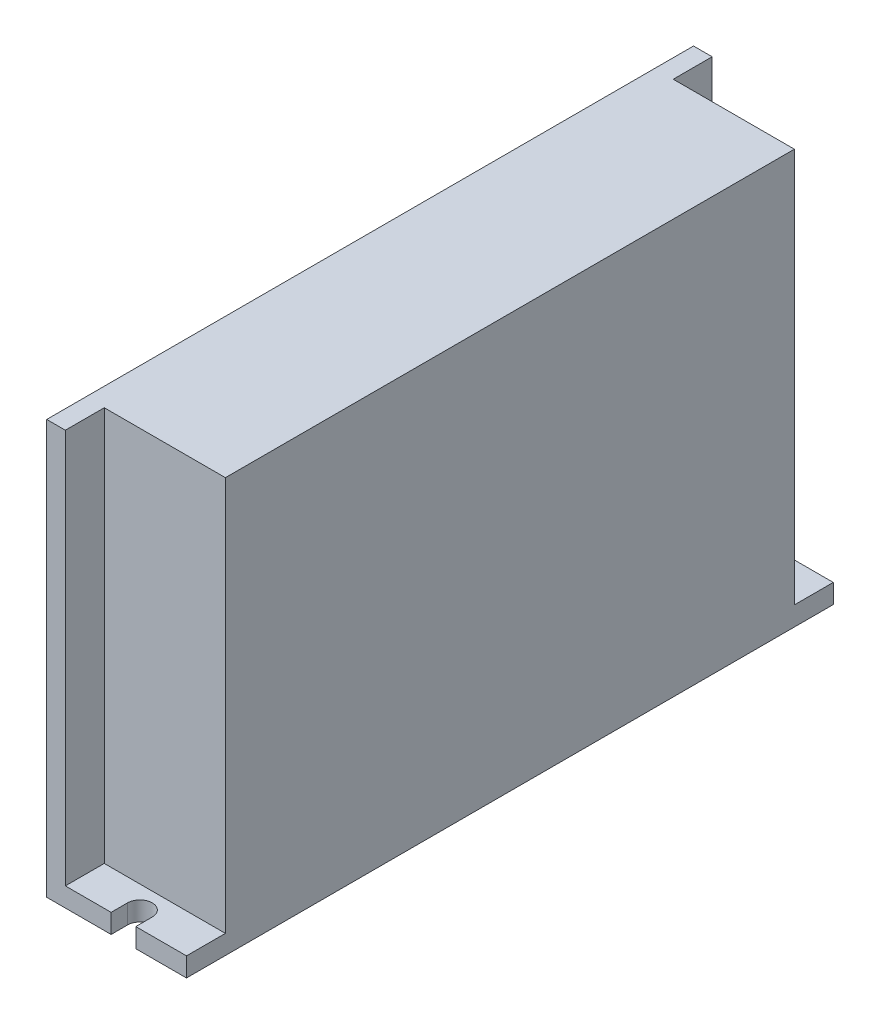
ISO-10303-21;
HEADER;
FILE_DESCRIPTION(('STEP AP214'),'2;1');
FILE_NAME('part.step','',(''),(''),'','','');
FILE_SCHEMA(('AUTOMOTIVE_DESIGN { 1 0 10303 214 1 1 1 1 }'));
ENDSEC;
DATA;
#1=APPLICATION_CONTEXT('core data for automotive mechanical design processes');
#2=APPLICATION_PROTOCOL_DEFINITION('international standard','automotive_design',2000,#1);
#3=PRODUCT_CONTEXT('',#1,'mechanical');
#4=PRODUCT('Part','Part','',(#3));
#5=PRODUCT_RELATED_PRODUCT_CATEGORY('part','',(#4));
#6=PRODUCT_DEFINITION_FORMATION('','',#4);
#7=PRODUCT_DEFINITION_CONTEXT('part definition',#1,'design');
#8=PRODUCT_DEFINITION('design','',#6,#7);
#9=PRODUCT_DEFINITION_SHAPE('','',#8);
#10=(LENGTH_UNIT() NAMED_UNIT(*) SI_UNIT(.MILLI.,.METRE.));
#11=(NAMED_UNIT(*) PLANE_ANGLE_UNIT() SI_UNIT($,.RADIAN.));
#12=(NAMED_UNIT(*) SI_UNIT($,.STERADIAN.) SOLID_ANGLE_UNIT());
#13=UNCERTAINTY_MEASURE_WITH_UNIT(LENGTH_MEASURE(1.E-05),#10,'distance_accuracy_value','');
#14=(GEOMETRIC_REPRESENTATION_CONTEXT(3) GLOBAL_UNCERTAINTY_ASSIGNED_CONTEXT((#13)) GLOBAL_UNIT_ASSIGNED_CONTEXT((#10,
#11,#12)) REPRESENTATION_CONTEXT('',''));
#15=CARTESIAN_POINT('',(0.,0.,0.));
#16=DIRECTION('',(0.,0.,1.));
#17=DIRECTION('',(1.,0.,0.));
#18=AXIS2_PLACEMENT_3D('',#15,#16,#17);
#19=CARTESIAN_POINT('',(0.,3.5,0.));
#20=DIRECTION('',(0.,-1.,0.));
#21=DIRECTION('',(0.,0.,-1.));
#22=AXIS2_PLACEMENT_3D('',#19,#20,#21);
#23=PLANE('',#22);
#24=DIRECTION('',(-1.,0.,0.));
#25=VECTOR('',#24,1.);
#26=CARTESIAN_POINT('',(-9.35,3.5,-51.9));
#27=LINE('',#26,#25);
#28=CARTESIAN_POINT('',(12.75,3.5,-51.9));
#29=VERTEX_POINT('',#28);
#30=CARTESIAN_POINT('',(-9.35,3.5,-51.9));
#31=VERTEX_POINT('',#30);
#32=EDGE_CURVE('E335',#29,#31,#27,.T.);
#33=ORIENTED_EDGE('',*,*,#32,.F.);
#34=DIRECTION('',(0.,0.,-1.));
#35=VECTOR('',#34,1.);
#36=CARTESIAN_POINT('',(12.75,3.5,59.));
#37=LINE('',#36,#35);
#38=CARTESIAN_POINT('',(12.75,3.5,-59.));
#39=VERTEX_POINT('',#38);
#40=EDGE_CURVE('E191',#29,#39,#37,.T.);
#41=ORIENTED_EDGE('',*,*,#40,.T.);
#42=DIRECTION('',(-1.,0.,0.));
#43=VECTOR('',#42,1.);
#44=CARTESIAN_POINT('',(-12.75,3.5,-59.));
#45=LINE('',#44,#43);
#46=CARTESIAN_POINT('',(3.49999999999999,3.5,-59.));
#47=VERTEX_POINT('',#46);
#48=EDGE_CURVE('E273',#39,#47,#45,.T.);
#49=ORIENTED_EDGE('',*,*,#48,.T.);
#50=DIRECTION('',(0.,0.,-1.));
#51=VECTOR('',#50,1.);
#52=CARTESIAN_POINT('',(3.49999999999999,3.5,-56.));
#53=LINE('',#52,#51);
#54=CARTESIAN_POINT('',(3.49999999999999,3.5,-56.));
#55=VERTEX_POINT('',#54);
#56=EDGE_CURVE('E257',#55,#47,#53,.T.);
#57=ORIENTED_EDGE('',*,*,#56,.F.);
#58=CARTESIAN_POINT('',(1.24999999999999,3.5,-56.));
#59=DIRECTION('',(0.,1.,0.));
#60=DIRECTION('',(0.,0.,1.));
#61=AXIS2_PLACEMENT_3D('',#58,#59,#60);
#62=CIRCLE('',#61,2.25);
#63=CARTESIAN_POINT('',(-1.00000000000001,3.5,-56.));
#64=VERTEX_POINT('',#63);
#65=EDGE_CURVE('E231',#64,#55,#62,.T.);
#66=ORIENTED_EDGE('',*,*,#65,.F.);
#67=DIRECTION('',(0.,0.,1.));
#68=VECTOR('',#67,1.);
#69=CARTESIAN_POINT('',(-1.00000000000001,3.5,-56.));
#70=LINE('',#69,#68);
#71=CARTESIAN_POINT('',(-1.00000000000002,3.5,-59.));
#72=VERTEX_POINT('',#71);
#73=EDGE_CURVE('E254',#72,#64,#70,.T.);
#74=ORIENTED_EDGE('',*,*,#73,.F.);
#75=CARTESIAN_POINT('',(-9.35,3.5,-59.));
#76=VERTEX_POINT('',#75);
#77=EDGE_CURVE('E272',#72,#76,#45,.T.);
#78=ORIENTED_EDGE('',*,*,#77,.T.);
#79=DIRECTION('',(0.,0.,-1.));
#80=VECTOR('',#79,1.);
#81=CARTESIAN_POINT('',(-9.35,3.5,-59.));
#82=LINE('',#81,#80);
#83=EDGE_CURVE('E192',#31,#76,#82,.T.);
#84=ORIENTED_EDGE('',*,*,#83,.F.);
#85=EDGE_LOOP('',(#33,#41,#49,#57,#66,#74,#78,#84));
#86=FACE_BOUND('',#85,.T.);
#87=ADVANCED_FACE('F45',(#86),#23,.F.);
#88=DIRECTION('',(1.,0.,0.));
#89=VECTOR('',#88,1.);
#90=CARTESIAN_POINT('',(-9.35,3.5,51.9));
#91=LINE('',#90,#89);
#92=CARTESIAN_POINT('',(-9.35,3.5,51.9));
#93=VERTEX_POINT('',#92);
#94=CARTESIAN_POINT('',(12.75,3.5,51.9));
#95=VERTEX_POINT('',#94);
#96=EDGE_CURVE('E186',#93,#95,#91,.T.);
#97=ORIENTED_EDGE('',*,*,#96,.F.);
#98=CARTESIAN_POINT('',(-9.34999999999999,3.5,59.));
#99=VERTEX_POINT('',#98);
#100=EDGE_CURVE('E68',#99,#93,#82,.T.);
#101=ORIENTED_EDGE('',*,*,#100,.F.);
#102=DIRECTION('',(1.,0.,0.));
#103=VECTOR('',#102,1.);
#104=CARTESIAN_POINT('',(-12.75,3.5,59.));
#105=LINE('',#104,#103);
#106=CARTESIAN_POINT('',(-1.,3.5,59.));
#107=VERTEX_POINT('',#106);
#108=EDGE_CURVE('E277',#99,#107,#105,.T.);
#109=ORIENTED_EDGE('',*,*,#108,.T.);
#110=DIRECTION('',(0.,0.,1.));
#111=VECTOR('',#110,1.);
#112=CARTESIAN_POINT('',(-1.,3.5,56.));
#113=LINE('',#112,#111);
#114=CARTESIAN_POINT('',(-1.,3.5,56.));
#115=VERTEX_POINT('',#114);
#116=EDGE_CURVE('E230',#115,#107,#113,.T.);
#117=ORIENTED_EDGE('',*,*,#116,.F.);
#118=CARTESIAN_POINT('',(1.25,3.5,56.));
#119=DIRECTION('',(0.,1.,0.));
#120=DIRECTION('',(0.,0.,1.));
#121=AXIS2_PLACEMENT_3D('',#118,#119,#120);
#122=CIRCLE('',#121,2.25);
#123=CARTESIAN_POINT('',(3.5,3.5,56.));
#124=VERTEX_POINT('',#123);
#125=EDGE_CURVE('E227',#124,#115,#122,.T.);
#126=ORIENTED_EDGE('',*,*,#125,.F.);
#127=DIRECTION('',(0.,0.,-1.));
#128=VECTOR('',#127,1.);
#129=CARTESIAN_POINT('',(3.5,3.5,56.));
#130=LINE('',#129,#128);
#131=CARTESIAN_POINT('',(3.5,3.5,59.));
#132=VERTEX_POINT('',#131);
#133=EDGE_CURVE('E220',#132,#124,#130,.T.);
#134=ORIENTED_EDGE('',*,*,#133,.F.);
#135=CARTESIAN_POINT('',(12.75,3.5,59.));
#136=VERTEX_POINT('',#135);
#137=EDGE_CURVE('E276',#132,#136,#105,.T.);
#138=ORIENTED_EDGE('',*,*,#137,.T.);
#139=EDGE_CURVE('E269',#136,#95,#37,.T.);
#140=ORIENTED_EDGE('',*,*,#139,.T.);
#141=EDGE_LOOP('',(#97,#101,#109,#117,#126,#134,#138,#140));
#142=FACE_BOUND('',#141,.T.);
#143=ADVANCED_FACE('F345',(#142),#23,.F.);
#144=CARTESIAN_POINT('',(-9.35,75.5,-59.));
#145=DIRECTION('',(-1.,0.,0.));
#146=DIRECTION('',(0.,0.,1.));
#147=AXIS2_PLACEMENT_3D('',#144,#145,#146);
#148=PLANE('',#147);
#149=DIRECTION('',(0.,-1.,0.));
#150=VECTOR('',#149,1.);
#151=CARTESIAN_POINT('',(-9.35,75.5,-51.9));
#152=LINE('',#151,#150);
#153=CARTESIAN_POINT('',(-9.35,75.5,-51.9));
#154=VERTEX_POINT('',#153);
#155=EDGE_CURVE('E60',#154,#31,#152,.T.);
#156=ORIENTED_EDGE('',*,*,#155,.T.);
#157=ORIENTED_EDGE('',*,*,#83,.T.);
#158=DIRECTION('',(0.,-1.,0.));
#159=VECTOR('',#158,1.);
#160=CARTESIAN_POINT('',(-9.35,75.5,-59.));
#161=LINE('',#160,#159);
#162=CARTESIAN_POINT('',(-9.35,75.5,-59.));
#163=VERTEX_POINT('',#162);
#164=EDGE_CURVE('E208',#163,#76,#161,.T.);
#165=ORIENTED_EDGE('',*,*,#164,.F.);
#166=DIRECTION('',(0.,0.,-1.));
#167=VECTOR('',#166,1.);
#168=CARTESIAN_POINT('',(-9.35,75.5,-59.));
#169=LINE('',#168,#167);
#170=EDGE_CURVE('E203',#154,#163,#169,.T.);
#171=ORIENTED_EDGE('',*,*,#170,.F.);
#172=EDGE_LOOP('',(#156,#157,#165,#171));
#173=FACE_BOUND('',#172,.T.);
#174=ADVANCED_FACE('F318',(#173),#148,.F.);
#175=DIRECTION('',(0.,-1.,0.));
#176=VECTOR('',#175,1.);
#177=CARTESIAN_POINT('',(-9.35,75.5,51.9));
#178=LINE('',#177,#176);
#179=CARTESIAN_POINT('',(-9.35,75.5,51.9));
#180=VERTEX_POINT('',#179);
#181=EDGE_CURVE('E195',#180,#93,#178,.T.);
#182=ORIENTED_EDGE('',*,*,#181,.F.);
#183=CARTESIAN_POINT('',(-9.34999999999999,75.5,59.));
#184=VERTEX_POINT('',#183);
#185=EDGE_CURVE('E204',#184,#180,#169,.T.);
#186=ORIENTED_EDGE('',*,*,#185,.F.);
#187=DIRECTION('',(0.,-1.,0.));
#188=VECTOR('',#187,1.);
#189=CARTESIAN_POINT('',(-9.34999999999999,75.5,59.));
#190=LINE('',#189,#188);
#191=EDGE_CURVE('E212',#184,#99,#190,.T.);
#192=ORIENTED_EDGE('',*,*,#191,.T.);
#193=ORIENTED_EDGE('',*,*,#100,.T.);
#194=EDGE_LOOP('',(#182,#186,#192,#193));
#195=FACE_BOUND('',#194,.T.);
#196=ADVANCED_FACE('F347',(#195),#148,.F.);
#197=CARTESIAN_POINT('',(-12.75,3.5,-59.));
#198=DIRECTION('',(0.,0.,1.));
#199=DIRECTION('',(1.,0.,0.));
#200=AXIS2_PLACEMENT_3D('',#197,#198,#199);
#201=PLANE('',#200);
#202=ORIENTED_EDGE('',*,*,#77,.F.);
#203=DIRECTION('',(0.,1.,0.));
#204=VECTOR('',#203,1.);
#205=CARTESIAN_POINT('',(-1.00000000000002,0.,-59.));
#206=LINE('',#205,#204);
#207=CARTESIAN_POINT('',(-1.00000000000002,0.,-59.));
#208=VERTEX_POINT('',#207);
#209=EDGE_CURVE('E251',#208,#72,#206,.T.);
#210=ORIENTED_EDGE('',*,*,#209,.F.);
#211=DIRECTION('',(-1.,0.,0.));
#212=VECTOR('',#211,1.);
#213=CARTESIAN_POINT('',(-12.75,0.,-59.));
#214=LINE('',#213,#212);
#215=CARTESIAN_POINT('',(-12.75,0.,-59.));
#216=VERTEX_POINT('',#215);
#217=EDGE_CURVE('E281',#208,#216,#214,.T.);
#218=ORIENTED_EDGE('',*,*,#217,.T.);
#219=DIRECTION('',(0.,-1.,0.));
#220=VECTOR('',#219,1.);
#221=CARTESIAN_POINT('',(-12.75,3.5,-59.));
#222=LINE('',#221,#220);
#223=CARTESIAN_POINT('',(-12.75,75.5,-59.));
#224=VERTEX_POINT('',#223);
#225=EDGE_CURVE('E53',#224,#216,#222,.T.);
#226=ORIENTED_EDGE('',*,*,#225,.F.);
#227=DIRECTION('',(-1.,0.,0.));
#228=VECTOR('',#227,1.);
#229=CARTESIAN_POINT('',(-12.75,75.5,-59.));
#230=LINE('',#229,#228);
#231=EDGE_CURVE('E206',#163,#224,#230,.T.);
#232=ORIENTED_EDGE('',*,*,#231,.F.);
#233=ORIENTED_EDGE('',*,*,#164,.T.);
#234=EDGE_LOOP('',(#202,#210,#218,#226,#232,#233));
#235=FACE_BOUND('',#234,.T.);
#236=ADVANCED_FACE('F314',(#235),#201,.F.);
#237=CARTESIAN_POINT('',(-12.75,3.5,59.));
#238=DIRECTION('',(0.,0.,-1.));
#239=DIRECTION('',(-1.,0.,0.));
#240=AXIS2_PLACEMENT_3D('',#237,#238,#239);
#241=PLANE('',#240);
#242=ORIENTED_EDGE('',*,*,#137,.F.);
#243=DIRECTION('',(0.,1.,0.));
#244=VECTOR('',#243,1.);
#245=CARTESIAN_POINT('',(3.5,0.,59.));
#246=LINE('',#245,#244);
#247=CARTESIAN_POINT('',(3.5,0.,59.));
#248=VERTEX_POINT('',#247);
#249=EDGE_CURVE('E239',#248,#132,#246,.T.);
#250=ORIENTED_EDGE('',*,*,#249,.F.);
#251=DIRECTION('',(1.,0.,0.));
#252=VECTOR('',#251,1.);
#253=CARTESIAN_POINT('',(-12.75,0.,59.));
#254=LINE('',#253,#252);
#255=CARTESIAN_POINT('',(12.75,0.,59.));
#256=VERTEX_POINT('',#255);
#257=EDGE_CURVE('E287',#248,#256,#254,.T.);
#258=ORIENTED_EDGE('',*,*,#257,.T.);
#259=DIRECTION('',(0.,-1.,0.));
#260=VECTOR('',#259,1.);
#261=CARTESIAN_POINT('',(12.75,3.5,59.));
#262=LINE('',#261,#260);
#263=EDGE_CURVE('E279',#136,#256,#262,.T.);
#264=ORIENTED_EDGE('',*,*,#263,.F.);
#265=EDGE_LOOP('',(#242,#250,#258,#264));
#266=FACE_BOUND('',#265,.T.);
#267=ADVANCED_FACE('F355',(#266),#241,.F.);
#268=CARTESIAN_POINT('',(12.75,3.5,59.));
#269=DIRECTION('',(-1.,0.,0.));
#270=DIRECTION('',(0.,0.,1.));
#271=AXIS2_PLACEMENT_3D('',#268,#269,#270);
#272=PLANE('',#271);
#273=DIRECTION('',(0.,0.,-1.));
#274=VECTOR('',#273,1.);
#275=CARTESIAN_POINT('',(12.75,0.,59.));
#276=LINE('',#275,#274);
#277=CARTESIAN_POINT('',(12.75,0.,-59.));
#278=VERTEX_POINT('',#277);
#279=EDGE_CURVE('E238',#256,#278,#276,.T.);
#280=ORIENTED_EDGE('',*,*,#279,.T.);
#281=DIRECTION('',(0.,-1.,0.));
#282=VECTOR('',#281,1.);
#283=CARTESIAN_POINT('',(12.75,3.5,-59.));
#284=LINE('',#283,#282);
#285=EDGE_CURVE('E11',#39,#278,#284,.T.);
#286=ORIENTED_EDGE('',*,*,#285,.F.);
#287=ORIENTED_EDGE('',*,*,#40,.F.);
#288=DIRECTION('',(0.,-1.,0.));
#289=VECTOR('',#288,1.);
#290=CARTESIAN_POINT('',(12.75,75.5,-51.9));
#291=LINE('',#290,#289);
#292=CARTESIAN_POINT('',(12.75,75.5,-51.9));
#293=VERTEX_POINT('',#292);
#294=EDGE_CURVE('E172',#293,#29,#291,.T.);
#295=ORIENTED_EDGE('',*,*,#294,.F.);
#296=DIRECTION('',(0.,0.,-1.));
#297=VECTOR('',#296,1.);
#298=CARTESIAN_POINT('',(12.75,75.5,51.9));
#299=LINE('',#298,#297);
#300=CARTESIAN_POINT('',(12.75,75.5,51.9));
#301=VERTEX_POINT('',#300);
#302=EDGE_CURVE('E177',#301,#293,#299,.T.);
#303=ORIENTED_EDGE('',*,*,#302,.F.);
#304=DIRECTION('',(0.,-1.,0.));
#305=VECTOR('',#304,1.);
#306=CARTESIAN_POINT('',(12.75,75.5,51.9));
#307=LINE('',#306,#305);
#308=EDGE_CURVE('E340',#301,#95,#307,.T.);
#309=ORIENTED_EDGE('',*,*,#308,.T.);
#310=ORIENTED_EDGE('',*,*,#139,.F.);
#311=ORIENTED_EDGE('',*,*,#263,.T.);
#312=EDGE_LOOP('',(#280,#286,#287,#295,#303,#309,#310,#311));
#313=FACE_BOUND('',#312,.T.);
#314=ADVANCED_FACE('F47',(#313),#272,.F.);
#315=CARTESIAN_POINT('',(3.49999999999999,0.,-59.));
#316=VERTEX_POINT('',#315);
#317=EDGE_CURVE('E282',#278,#316,#214,.T.);
#318=ORIENTED_EDGE('',*,*,#317,.T.);
#319=DIRECTION('',(0.,1.,0.));
#320=VECTOR('',#319,1.);
#321=CARTESIAN_POINT('',(3.49999999999999,0.,-59.));
#322=LINE('',#321,#320);
#323=EDGE_CURVE('E248',#316,#47,#322,.T.);
#324=ORIENTED_EDGE('',*,*,#323,.T.);
#325=ORIENTED_EDGE('',*,*,#48,.F.);
#326=ORIENTED_EDGE('',*,*,#285,.T.);
#327=EDGE_LOOP('',(#318,#324,#325,#326));
#328=FACE_BOUND('',#327,.T.);
#329=ADVANCED_FACE('F334',(#328),#201,.F.);
#330=CARTESIAN_POINT('',(-12.75,3.5,59.));
#331=DIRECTION('',(1.,0.,0.));
#332=DIRECTION('',(0.,0.,-1.));
#333=AXIS2_PLACEMENT_3D('',#330,#331,#332);
#334=PLANE('',#333);
#335=DIRECTION('',(0.,0.,1.));
#336=VECTOR('',#335,1.);
#337=CARTESIAN_POINT('',(-12.75,0.,59.));
#338=LINE('',#337,#336);
#339=CARTESIAN_POINT('',(-12.75,0.,59.));
#340=VERTEX_POINT('',#339);
#341=EDGE_CURVE('E285',#216,#340,#338,.T.);
#342=ORIENTED_EDGE('',*,*,#341,.T.);
#343=DIRECTION('',(0.,-1.,0.));
#344=VECTOR('',#343,1.);
#345=CARTESIAN_POINT('',(-12.75,3.5,59.));
#346=LINE('',#345,#344);
#347=CARTESIAN_POINT('',(-12.75,75.5,59.));
#348=VERTEX_POINT('',#347);
#349=EDGE_CURVE('E293',#348,#340,#346,.T.);
#350=ORIENTED_EDGE('',*,*,#349,.F.);
#351=DIRECTION('',(0.,0.,1.));
#352=VECTOR('',#351,1.);
#353=CARTESIAN_POINT('',(-12.75,75.5,-59.));
#354=LINE('',#353,#352);
#355=EDGE_CURVE('E199',#224,#348,#354,.T.);
#356=ORIENTED_EDGE('',*,*,#355,.F.);
#357=ORIENTED_EDGE('',*,*,#225,.T.);
#358=EDGE_LOOP('',(#342,#350,#356,#357));
#359=FACE_BOUND('',#358,.T.);
#360=ADVANCED_FACE('F299',(#359),#334,.F.);
#361=CARTESIAN_POINT('',(-1.,0.,59.));
#362=VERTEX_POINT('',#361);
#363=EDGE_CURVE('E288',#340,#362,#254,.T.);
#364=ORIENTED_EDGE('',*,*,#363,.T.);
#365=DIRECTION('',(0.,1.,0.));
#366=VECTOR('',#365,1.);
#367=CARTESIAN_POINT('',(-1.,0.,59.));
#368=LINE('',#367,#366);
#369=EDGE_CURVE('E241',#362,#107,#368,.T.);
#370=ORIENTED_EDGE('',*,*,#369,.T.);
#371=ORIENTED_EDGE('',*,*,#108,.F.);
#372=ORIENTED_EDGE('',*,*,#191,.F.);
#373=DIRECTION('',(1.,0.,0.));
#374=VECTOR('',#373,1.);
#375=CARTESIAN_POINT('',(-12.75,75.5,59.));
#376=LINE('',#375,#374);
#377=EDGE_CURVE('E201',#348,#184,#376,.T.);
#378=ORIENTED_EDGE('',*,*,#377,.F.);
#379=ORIENTED_EDGE('',*,*,#349,.T.);
#380=EDGE_LOOP('',(#364,#370,#371,#372,#378,#379));
#381=FACE_BOUND('',#380,.T.);
#382=ADVANCED_FACE('F308',(#381),#241,.F.);
#383=CARTESIAN_POINT('',(0.,0.,0.));
#384=DIRECTION('',(0.,-1.,0.));
#385=DIRECTION('',(0.,0.,-1.));
#386=AXIS2_PLACEMENT_3D('',#383,#384,#385);
#387=PLANE('',#386);
#388=DIRECTION('',(0.,0.,-1.));
#389=VECTOR('',#388,1.);
#390=CARTESIAN_POINT('',(3.5,0.,56.));
#391=LINE('',#390,#389);
#392=CARTESIAN_POINT('',(3.5,0.,56.));
#393=VERTEX_POINT('',#392);
#394=EDGE_CURVE('E223',#248,#393,#391,.T.);
#395=ORIENTED_EDGE('',*,*,#394,.T.);
#396=CARTESIAN_POINT('',(1.25,0.,56.));
#397=DIRECTION('',(0.,1.,0.));
#398=DIRECTION('',(0.,0.,1.));
#399=AXIS2_PLACEMENT_3D('',#396,#397,#398);
#400=CIRCLE('',#399,2.25);
#401=CARTESIAN_POINT('',(-1.,0.,56.));
#402=VERTEX_POINT('',#401);
#403=EDGE_CURVE('E216',#393,#402,#400,.T.);
#404=ORIENTED_EDGE('',*,*,#403,.T.);
#405=DIRECTION('',(0.,0.,1.));
#406=VECTOR('',#405,1.);
#407=CARTESIAN_POINT('',(-1.,0.,56.));
#408=LINE('',#407,#406);
#409=EDGE_CURVE('E219',#402,#362,#408,.T.);
#410=ORIENTED_EDGE('',*,*,#409,.T.);
#411=ORIENTED_EDGE('',*,*,#363,.F.);
#412=ORIENTED_EDGE('',*,*,#341,.F.);
#413=ORIENTED_EDGE('',*,*,#217,.F.);
#414=DIRECTION('',(0.,0.,1.));
#415=VECTOR('',#414,1.);
#416=CARTESIAN_POINT('',(-1.00000000000001,0.,-56.));
#417=LINE('',#416,#415);
#418=CARTESIAN_POINT('',(-1.00000000000001,0.,-56.));
#419=VERTEX_POINT('',#418);
#420=EDGE_CURVE('E247',#208,#419,#417,.T.);
#421=ORIENTED_EDGE('',*,*,#420,.T.);
#422=CARTESIAN_POINT('',(1.24999999999999,0.,-56.));
#423=DIRECTION('',(0.,1.,0.));
#424=DIRECTION('',(0.,0.,1.));
#425=AXIS2_PLACEMENT_3D('',#422,#423,#424);
#426=CIRCLE('',#425,2.25);
#427=CARTESIAN_POINT('',(3.49999999999999,0.,-56.));
#428=VERTEX_POINT('',#427);
#429=EDGE_CURVE('E258',#419,#428,#426,.T.);
#430=ORIENTED_EDGE('',*,*,#429,.T.);
#431=DIRECTION('',(0.,0.,-1.));
#432=VECTOR('',#431,1.);
#433=CARTESIAN_POINT('',(3.49999999999999,0.,-56.));
#434=LINE('',#433,#432);
#435=EDGE_CURVE('E264',#428,#316,#434,.T.);
#436=ORIENTED_EDGE('',*,*,#435,.T.);
#437=ORIENTED_EDGE('',*,*,#317,.F.);
#438=ORIENTED_EDGE('',*,*,#279,.F.);
#439=ORIENTED_EDGE('',*,*,#257,.F.);
#440=EDGE_LOOP('',(#395,#404,#410,#411,#412,#413,#421,#430,#436,#437,#438,#439));
#441=FACE_BOUND('',#440,.T.);
#442=ADVANCED_FACE('F305',(#441),#387,.T.);
#443=CARTESIAN_POINT('',(1.24999999999999,0.,-56.));
#444=DIRECTION('',(0.,1.,0.));
#445=DIRECTION('',(0.,0.,1.));
#446=AXIS2_PLACEMENT_3D('',#443,#444,#445);
#447=CYLINDRICAL_SURFACE('',#446,2.25);
#448=ORIENTED_EDGE('',*,*,#65,.T.);
#449=DIRECTION('',(0.,1.,0.));
#450=VECTOR('',#449,1.);
#451=CARTESIAN_POINT('',(3.49999999999999,0.,-56.));
#452=LINE('',#451,#450);
#453=EDGE_CURVE('E245',#428,#55,#452,.T.);
#454=ORIENTED_EDGE('',*,*,#453,.F.);
#455=ORIENTED_EDGE('',*,*,#429,.F.);
#456=DIRECTION('',(0.,1.,0.));
#457=VECTOR('',#456,1.);
#458=CARTESIAN_POINT('',(-1.00000000000001,0.,-56.));
#459=LINE('',#458,#457);
#460=EDGE_CURVE('E215',#419,#64,#459,.T.);
#461=ORIENTED_EDGE('',*,*,#460,.T.);
#462=EDGE_LOOP('',(#448,#454,#455,#461));
#463=FACE_BOUND('',#462,.T.);
#464=ADVANCED_FACE('F329',(#463),#447,.F.);
#465=CARTESIAN_POINT('',(-1.00000000000001,0.,-56.));
#466=DIRECTION('',(-1.,0.,0.));
#467=DIRECTION('',(0.,0.,1.));
#468=AXIS2_PLACEMENT_3D('',#465,#466,#467);
#469=PLANE('',#468);
#470=ORIENTED_EDGE('',*,*,#73,.T.);
#471=ORIENTED_EDGE('',*,*,#460,.F.);
#472=ORIENTED_EDGE('',*,*,#420,.F.);
#473=ORIENTED_EDGE('',*,*,#209,.T.);
#474=EDGE_LOOP('',(#470,#471,#472,#473));
#475=FACE_BOUND('',#474,.T.);
#476=ADVANCED_FACE('F325',(#475),#469,.F.);
#477=CARTESIAN_POINT('',(3.49999999999999,0.,-56.));
#478=DIRECTION('',(1.,0.,0.));
#479=DIRECTION('',(0.,0.,-1.));
#480=AXIS2_PLACEMENT_3D('',#477,#478,#479);
#481=PLANE('',#480);
#482=ORIENTED_EDGE('',*,*,#56,.T.);
#483=ORIENTED_EDGE('',*,*,#323,.F.);
#484=ORIENTED_EDGE('',*,*,#435,.F.);
#485=ORIENTED_EDGE('',*,*,#453,.T.);
#486=EDGE_LOOP('',(#482,#483,#484,#485));
#487=FACE_BOUND('',#486,.T.);
#488=ADVANCED_FACE('F331',(#487),#481,.F.);
#489=CARTESIAN_POINT('',(1.25,0.,56.));
#490=DIRECTION('',(0.,1.,0.));
#491=DIRECTION('',(0.,0.,1.));
#492=AXIS2_PLACEMENT_3D('',#489,#490,#491);
#493=CYLINDRICAL_SURFACE('',#492,2.25);
#494=ORIENTED_EDGE('',*,*,#125,.T.);
#495=DIRECTION('',(0.,1.,0.));
#496=VECTOR('',#495,1.);
#497=CARTESIAN_POINT('',(-1.,0.,56.));
#498=LINE('',#497,#496);
#499=EDGE_CURVE('E226',#402,#115,#498,.T.);
#500=ORIENTED_EDGE('',*,*,#499,.F.);
#501=ORIENTED_EDGE('',*,*,#403,.F.);
#502=DIRECTION('',(0.,1.,0.));
#503=VECTOR('',#502,1.);
#504=CARTESIAN_POINT('',(3.5,0.,56.));
#505=LINE('',#504,#503);
#506=EDGE_CURVE('E236',#393,#124,#505,.T.);
#507=ORIENTED_EDGE('',*,*,#506,.T.);
#508=EDGE_LOOP('',(#494,#500,#501,#507));
#509=FACE_BOUND('',#508,.T.);
#510=ADVANCED_FACE('F393',(#509),#493,.F.);
#511=CARTESIAN_POINT('',(3.5,0.,56.));
#512=DIRECTION('',(1.,0.,0.));
#513=DIRECTION('',(0.,0.,-1.));
#514=AXIS2_PLACEMENT_3D('',#511,#512,#513);
#515=PLANE('',#514);
#516=ORIENTED_EDGE('',*,*,#133,.T.);
#517=ORIENTED_EDGE('',*,*,#506,.F.);
#518=ORIENTED_EDGE('',*,*,#394,.F.);
#519=ORIENTED_EDGE('',*,*,#249,.T.);
#520=EDGE_LOOP('',(#516,#517,#518,#519));
#521=FACE_BOUND('',#520,.T.);
#522=ADVANCED_FACE('F389',(#521),#515,.F.);
#523=CARTESIAN_POINT('',(-1.,0.,56.));
#524=DIRECTION('',(-1.,0.,0.));
#525=DIRECTION('',(0.,0.,1.));
#526=AXIS2_PLACEMENT_3D('',#523,#524,#525);
#527=PLANE('',#526);
#528=ORIENTED_EDGE('',*,*,#116,.T.);
#529=ORIENTED_EDGE('',*,*,#369,.F.);
#530=ORIENTED_EDGE('',*,*,#409,.F.);
#531=ORIENTED_EDGE('',*,*,#499,.T.);
#532=EDGE_LOOP('',(#528,#529,#530,#531));
#533=FACE_BOUND('',#532,.T.);
#534=ADVANCED_FACE('F395',(#533),#527,.F.);
#535=CARTESIAN_POINT('',(0.,75.5,0.));
#536=DIRECTION('',(0.,1.,0.));
#537=DIRECTION('',(0.,0.,1.));
#538=AXIS2_PLACEMENT_3D('',#535,#536,#537);
#539=PLANE('',#538);
#540=ORIENTED_EDGE('',*,*,#355,.T.);
#541=ORIENTED_EDGE('',*,*,#377,.T.);
#542=ORIENTED_EDGE('',*,*,#185,.T.);
#543=DIRECTION('',(1.,0.,0.));
#544=VECTOR('',#543,1.);
#545=CARTESIAN_POINT('',(-9.35,75.5,51.9));
#546=LINE('',#545,#544);
#547=EDGE_CURVE('E176',#180,#301,#546,.T.);
#548=ORIENTED_EDGE('',*,*,#547,.T.);
#549=ORIENTED_EDGE('',*,*,#302,.T.);
#550=DIRECTION('',(-1.,0.,0.));
#551=VECTOR('',#550,1.);
#552=CARTESIAN_POINT('',(-9.35,75.5,-51.9));
#553=LINE('',#552,#551);
#554=EDGE_CURVE('E168',#293,#154,#553,.T.);
#555=ORIENTED_EDGE('',*,*,#554,.T.);
#556=ORIENTED_EDGE('',*,*,#170,.T.);
#557=ORIENTED_EDGE('',*,*,#231,.T.);
#558=EDGE_LOOP('',(#540,#541,#542,#548,#549,#555,#556,#557));
#559=FACE_BOUND('',#558,.T.);
#560=ADVANCED_FACE('F181',(#559),#539,.T.);
#561=CARTESIAN_POINT('',(-9.35,75.5,-51.9));
#562=DIRECTION('',(0.,0.,1.));
#563=DIRECTION('',(1.,0.,0.));
#564=AXIS2_PLACEMENT_3D('',#561,#562,#563);
#565=PLANE('',#564);
#566=ORIENTED_EDGE('',*,*,#32,.T.);
#567=ORIENTED_EDGE('',*,*,#155,.F.);
#568=ORIENTED_EDGE('',*,*,#554,.F.);
#569=ORIENTED_EDGE('',*,*,#294,.T.);
#570=EDGE_LOOP('',(#566,#567,#568,#569));
#571=FACE_BOUND('',#570,.T.);
#572=ADVANCED_FACE('F170',(#571),#565,.F.);
#573=CARTESIAN_POINT('',(-9.35,75.5,51.9));
#574=DIRECTION('',(0.,0.,-1.));
#575=DIRECTION('',(-1.,0.,0.));
#576=AXIS2_PLACEMENT_3D('',#573,#574,#575);
#577=PLANE('',#576);
#578=ORIENTED_EDGE('',*,*,#96,.T.);
#579=ORIENTED_EDGE('',*,*,#308,.F.);
#580=ORIENTED_EDGE('',*,*,#547,.F.);
#581=ORIENTED_EDGE('',*,*,#181,.T.);
#582=EDGE_LOOP('',(#578,#579,#580,#581));
#583=FACE_BOUND('',#582,.T.);
#584=ADVANCED_FACE('F343',(#583),#577,.F.);
#585=CLOSED_SHELL('',(#87,#143,#174,#196,#236,#267,#314,#329,#360,#382,#442,#464,#476,#488,#510,
#522,#534,#560,#572,#584));
#586=MANIFOLD_SOLID_BREP('B2',#585);
#587=ADVANCED_BREP_SHAPE_REPRESENTATION('',(#18,#586),#14);
#588=SHAPE_DEFINITION_REPRESENTATION(#9,#587);
ENDSEC;
END-ISO-10303-21;
